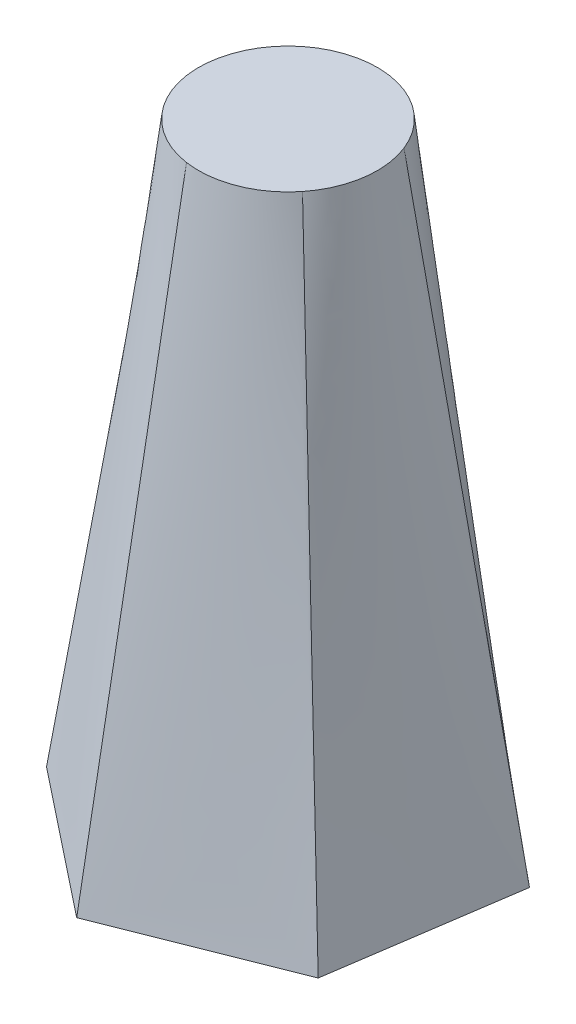
ISO-10303-21;
HEADER;
FILE_DESCRIPTION(('STEP AP214'),'2;1');
FILE_NAME('part.step','',(''),(''),'','','');
FILE_SCHEMA(('AUTOMOTIVE_DESIGN { 1 0 10303 214 1 1 1 1 }'));
ENDSEC;
DATA;
#1=APPLICATION_CONTEXT('core data for automotive mechanical design processes');
#2=APPLICATION_PROTOCOL_DEFINITION('international standard','automotive_design',2000,#1);
#3=PRODUCT_CONTEXT('',#1,'mechanical');
#4=PRODUCT('Part','Part','',(#3));
#5=PRODUCT_RELATED_PRODUCT_CATEGORY('part','',(#4));
#6=PRODUCT_DEFINITION_FORMATION('','',#4);
#7=PRODUCT_DEFINITION_CONTEXT('part definition',#1,'design');
#8=PRODUCT_DEFINITION('design','',#6,#7);
#9=PRODUCT_DEFINITION_SHAPE('','',#8);
#10=(LENGTH_UNIT() NAMED_UNIT(*) SI_UNIT(.MILLI.,.METRE.));
#11=(NAMED_UNIT(*) PLANE_ANGLE_UNIT() SI_UNIT($,.RADIAN.));
#12=(NAMED_UNIT(*) SI_UNIT($,.STERADIAN.) SOLID_ANGLE_UNIT());
#13=UNCERTAINTY_MEASURE_WITH_UNIT(LENGTH_MEASURE(1.E-05),#10,'distance_accuracy_value','');
#14=(GEOMETRIC_REPRESENTATION_CONTEXT(3) GLOBAL_UNCERTAINTY_ASSIGNED_CONTEXT((#13)) GLOBAL_UNIT_ASSIGNED_CONTEXT((#10,
#11,#12)) REPRESENTATION_CONTEXT('',''));
#15=CARTESIAN_POINT('',(0.,0.,0.));
#16=DIRECTION('',(0.,0.,1.));
#17=DIRECTION('',(1.,0.,0.));
#18=AXIS2_PLACEMENT_3D('',#15,#16,#17);
#19=CARTESIAN_POINT('',(0.,100.,0.));
#20=DIRECTION('',(0.,1.,0.));
#21=DIRECTION('',(0.,0.,1.));
#22=AXIS2_PLACEMENT_3D('',#19,#20,#21);
#23=PLANE('',#22);
#24=CARTESIAN_POINT('',(0.,100.,0.));
#25=DIRECTION('',(0.,1.,0.));
#26=DIRECTION('',(0.,0.,1.));
#27=AXIS2_PLACEMENT_3D('',#24,#25,#26);
#28=CIRCLE('',#27,14.5793534464195);
#29=CARTESIAN_POINT('',(2.13323559379029,100.,-14.422442678583));
#30=VERTEX_POINT('',#29);
#31=CARTESIAN_POINT('',(-11.4235839473826,100.,-9.05865755577106));
#32=VERTEX_POINT('',#31);
#33=EDGE_CURVE('E12',#30,#32,#28,.T.);
#34=ORIENTED_EDGE('',*,*,#33,.T.);
#35=CARTESIAN_POINT('',(-13.5568195411729,100.,5.36378512281191));
#36=VERTEX_POINT('',#35);
#37=EDGE_CURVE('E98',#32,#36,#28,.T.);
#38=ORIENTED_EDGE('',*,*,#37,.T.);
#39=CARTESIAN_POINT('',(-2.1332355937903,100.,14.422442678583));
#40=VERTEX_POINT('',#39);
#41=EDGE_CURVE('E341',#36,#40,#28,.T.);
#42=ORIENTED_EDGE('',*,*,#41,.T.);
#43=CARTESIAN_POINT('',(11.4235839473826,100.,9.05865755577104));
#44=VERTEX_POINT('',#43);
#45=EDGE_CURVE('E226',#40,#44,#28,.T.);
#46=ORIENTED_EDGE('',*,*,#45,.T.);
#47=CARTESIAN_POINT('',(13.5568195411729,100.,-5.3637851228119));
#48=VERTEX_POINT('',#47);
#49=EDGE_CURVE('E348',#44,#48,#28,.T.);
#50=ORIENTED_EDGE('',*,*,#49,.T.);
#51=EDGE_CURVE('E174',#48,#30,#28,.T.);
#52=ORIENTED_EDGE('',*,*,#51,.T.);
#53=EDGE_LOOP('',(#34,#38,#42,#46,#50,#52));
#54=FACE_BOUND('',#53,.T.);
#55=ADVANCED_FACE('F87',(#54),#23,.T.);
#56=CARTESIAN_POINT('',(0.,0.,0.));
#57=DIRECTION('',(0.,1.,0.));
#58=DIRECTION('',(0.,0.,1.));
#59=AXIS2_PLACEMENT_3D('',#56,#57,#58);
#60=PLANE('',#59);
#61=DIRECTION('',(0.146318943540954,0.,-0.989237467325748));
#62=VECTOR('',#61,1.);
#63=CARTESIAN_POINT('',(23.7746978672608,0.,18.8528265265456));
#64=LINE('',#63,#62);
#65=CARTESIAN_POINT('',(23.7746978672608,0.,18.8528265265456));
#66=VERTEX_POINT('',#65);
#67=CARTESIAN_POINT('',(28.21437563876,0.,-11.1630790570747));
#68=VERTEX_POINT('',#67);
#69=EDGE_CURVE('E146',#66,#68,#64,.T.);
#70=ORIENTED_EDGE('',*,*,#69,.F.);
#71=DIRECTION('',(0.929864248849953,0.,-0.367902811501507));
#72=VECTOR('',#71,1.);
#73=CARTESIAN_POINT('',(-4.43967777149929,0.,30.0159055836203));
#74=LINE('',#73,#72);
#75=CARTESIAN_POINT('',(-4.43967777149929,0.,30.0159055836203));
#76=VERTEX_POINT('',#75);
#77=EDGE_CURVE('E280',#76,#66,#74,.T.);
#78=ORIENTED_EDGE('',*,*,#77,.F.);
#79=DIRECTION('',(0.783545305308998,0.,0.621334655824242));
#80=VECTOR('',#79,1.);
#81=CARTESIAN_POINT('',(-28.21437563876,0.,11.1630790570747));
#82=LINE('',#81,#80);
#83=CARTESIAN_POINT('',(-28.21437563876,0.,11.1630790570747));
#84=VERTEX_POINT('',#83);
#85=EDGE_CURVE('E290',#84,#76,#82,.T.);
#86=ORIENTED_EDGE('',*,*,#85,.F.);
#87=DIRECTION('',(-0.146318943540955,0.,0.989237467325747));
#88=VECTOR('',#87,1.);
#89=CARTESIAN_POINT('',(-23.7746978672607,0.,-18.8528265265456));
#90=LINE('',#89,#88);
#91=CARTESIAN_POINT('',(-23.7746978672607,0.,-18.8528265265456));
#92=VERTEX_POINT('',#91);
#93=EDGE_CURVE('E376',#92,#84,#90,.T.);
#94=ORIENTED_EDGE('',*,*,#93,.F.);
#95=DIRECTION('',(-0.929864248849953,0.,0.367902811501505));
#96=VECTOR('',#95,1.);
#97=CARTESIAN_POINT('',(4.43967777149931,0.,-30.0159055836203));
#98=LINE('',#97,#96);
#99=CARTESIAN_POINT('',(4.43967777149931,0.,-30.0159055836203));
#100=VERTEX_POINT('',#99);
#101=EDGE_CURVE('E149',#100,#92,#98,.T.);
#102=ORIENTED_EDGE('',*,*,#101,.F.);
#103=DIRECTION('',(-0.783545305308998,0.,-0.621334655824242));
#104=VECTOR('',#103,1.);
#105=CARTESIAN_POINT('',(28.21437563876,0.,-11.1630790570747));
#106=LINE('',#105,#104);
#107=EDGE_CURVE('E142',#68,#100,#106,.T.);
#108=ORIENTED_EDGE('',*,*,#107,.F.);
#109=EDGE_LOOP('',(#70,#78,#86,#94,#102,#108));
#110=FACE_BOUND('',#109,.T.);
#111=ADVANCED_FACE('F145',(#110),#60,.F.);
#112=CARTESIAN_POINT('',(-23.7746978672607,0.,-18.8528265265456));
#113=CARTESIAN_POINT('',(-11.4235839473826,100.,-9.05865755577106));
#114=CARTESIAN_POINT('',(-24.1446710148857,0.,-16.3515010612439));
#115=CARTESIAN_POINT('',(-12.1784720770302,100.,-8.10669222682251));
#116=CARTESIAN_POINT('',(-24.5146441625106,0.,-13.8501755959422));
#117=CARTESIAN_POINT('',(-12.8386403325706,100.,-7.02589858761081));
#118=CARTESIAN_POINT('',(-25.2545904577605,0.,-8.84752466533885));
#119=CARTESIAN_POINT('',(-13.865978770345,100.,-4.68279502998372));
#120=CARTESIAN_POINT('',(-25.6245636053854,0.,-6.34619920003716));
#121=CARTESIAN_POINT('',(-14.2319097603758,100.,-3.42139621666044));
#122=CARTESIAN_POINT('',(-26.3645099006353,0.,-1.34354826943378));
#123=CARTESIAN_POINT('',(-14.6129755967901,100.,-0.845074970920135));
#124=CARTESIAN_POINT('',(-26.7344830482603,0.,1.15777719586791));
#125=CARTESIAN_POINT('',(-14.6278734872154,100.,0.468245442603986));
#126=CARTESIAN_POINT('',(-27.4744293435101,0.,6.16042812647129));
#127=CARTESIAN_POINT('',(-14.3228253174044,100.,3.00842342093317));
#128=CARTESIAN_POINT('',(-27.8444024911351,0.,8.66175359177297));
#129=CARTESIAN_POINT('',(-14.0038016347405,100.,4.23405016104751));
#130=CARTESIAN_POINT('',(-28.21437563876,0.,11.1630790570747));
#131=CARTESIAN_POINT('',(-13.5568195411729,100.,5.36378512281191));
#132=B_SPLINE_SURFACE_WITH_KNOTS('',3,1,((#112,#113),(#114,#115),(#116,#117),(#118,#119),(#120,
#121),(#122,#123),(#124,#125),(#126,#127),(#128,#129),(#130,#131)),.UNSPECIFIED.,.F.,.F.,.F.,(4,
2,2,2,4),(2,2),(0.,0.25,0.5,0.75,1.),(0.,1.),.UNSPECIFIED.);
#133=DIRECTION('',(0.144787785546289,0.987803045625892,-0.057285602107445));
#134=VECTOR('',#133,1.);
#135=CARTESIAN_POINT('',(-20.8855975899664,50.,8.26343208994328));
#136=LINE('',#135,#134);
#137=EDGE_CURVE('E266',#84,#36,#136,.T.);
#138=DIRECTION('',(-0.12200467946928,-0.987803045625892,-0.0967470993870575));
#139=VECTOR('',#138,1.);
#140=CARTESIAN_POINT('',(-17.5991409073217,50.,-13.9557420411584));
#141=LINE('',#140,#139);
#142=EDGE_CURVE('E273',#32,#92,#141,.T.);
#143=ORIENTED_EDGE('',*,*,#93,.T.);
#144=ORIENTED_EDGE('',*,*,#137,.T.);
#145=ORIENTED_EDGE('',*,*,#37,.F.);
#146=ORIENTED_EDGE('',*,*,#142,.T.);
#147=EDGE_LOOP('',(#143,#144,#145,#146));
#148=FACE_BOUND('',#147,.T.);
#149=ADVANCED_FACE('F303',(#148),#132,.T.);
#150=CARTESIAN_POINT('',(-28.21437563876,0.,11.1630790570747));
#151=CARTESIAN_POINT('',(-13.5568195411729,100.,5.36378512281191));
#152=CARTESIAN_POINT('',(-26.2331508164882,0.,12.7341479342869));
#153=CARTESIAN_POINT('',(-13.1098374476052,100.,6.49352008457632));
#154=CARTESIAN_POINT('',(-24.2519259942165,0.,14.305216811499));
#155=CARTESIAN_POINT('',(-12.5039268275694,100.,7.60563938425219));
#156=CARTESIAN_POINT('',(-20.289476349673,0.,17.4473545659233));
#157=CARTESIAN_POINT('',(-10.9884088418539,100.,9.66689234846263));
#158=CARTESIAN_POINT('',(-18.3082515274012,0.,19.0184234431355));
#159=CARTESIAN_POINT('',(-10.0789709202278,100.,10.6144972885229));
#160=CARTESIAN_POINT('',(-14.3458018828578,0.,22.1605611975598));
#161=CARTESIAN_POINT('',(-8.03834419131429,100.,12.2326706062422));
#162=CARTESIAN_POINT('',(-12.3645770605861,0.,23.7316300747719));
#163=CARTESIAN_POINT('',(-6.90842429510637,100.,12.9022327645754));
#164=CARTESIAN_POINT('',(-8.40212741604266,0.,26.8737678291961));
#165=CARTESIAN_POINT('',(-4.55604155083398,100.,13.9081422893057));
#166=CARTESIAN_POINT('',(-6.42090259377097,0.,28.4448367064082));
#167=CARTESIAN_POINT('',(-3.33510581700554,100.,14.2446730457671));
#168=CARTESIAN_POINT('',(-4.4396777714993,0.,30.0159055836203));
#169=CARTESIAN_POINT('',(-2.1332355937903,100.,14.422442678583));
#170=B_SPLINE_SURFACE_WITH_KNOTS('',3,1,((#150,#151),(#152,#153),(#154,#155),(#156,#157),(#158,
#159),(#160,#161),(#162,#163),(#164,#165),(#166,#167),(#168,#169)),.UNSPECIFIED.,.F.,.F.,.F.,(4,
2,2,2,4),(2,2),(0.,0.25,0.5,0.75,1.),(0.,1.),.UNSPECIFIED.);
#171=DIRECTION('',(0.0227831060770097,0.987803045625892,-0.154032701494503));
#172=VECTOR('',#171,1.);
#173=CARTESIAN_POINT('',(-3.2864566826448,50.,22.2191741311016));
#174=LINE('',#173,#172);
#175=EDGE_CURVE('E182',#76,#40,#174,.T.);
#176=ORIENTED_EDGE('',*,*,#85,.T.);
#177=ORIENTED_EDGE('',*,*,#175,.T.);
#178=ORIENTED_EDGE('',*,*,#41,.F.);
#179=ORIENTED_EDGE('',*,*,#137,.F.);
#180=EDGE_LOOP('',(#176,#177,#178,#179));
#181=FACE_BOUND('',#180,.T.);
#182=ADVANCED_FACE('F293',(#181),#170,.T.);
#183=CARTESIAN_POINT('',(4.43967777149931,0.,-30.0159055836203));
#184=CARTESIAN_POINT('',(2.13323559379029,100.,-14.422442678583));
#185=CARTESIAN_POINT('',(2.08847980160264,0.,-29.0856489955308));
#186=CARTESIAN_POINT('',(0.931365370575047,100.,-14.6002123113988));
#187=CARTESIAN_POINT('',(-0.262718168294023,0.,-28.1553924074412));
#188=CARTESIAN_POINT('',(-0.334713505001106,100.,-14.631537971863));
#189=CARTESIAN_POINT('',(-4.96511410808736,0.,-26.2948792312621));
#190=CARTESIAN_POINT('',(-2.87756992849109,100.,-14.3496873784464));
#191=CARTESIAN_POINT('',(-7.31631207798403,0.,-25.3646226431725));
#192=CARTESIAN_POINT('',(-4.152938840148,100.,-14.0358935051834));
#193=CARTESIAN_POINT('',(-12.0187080177774,0.,-23.5041094669934));
#194=CARTESIAN_POINT('',(-6.57463140547583,100.,-13.0777455771624));
#195=CARTESIAN_POINT('',(-14.369905987674,0.,-22.5738528789039));
#196=CARTESIAN_POINT('',(-7.71944919210904,100.,-12.4339873219714));
#197=CARTESIAN_POINT('',(-19.0723019274674,0.,-20.7133397027248));
#198=CARTESIAN_POINT('',(-9.7667837665704,100.,-10.8997188683725));
#199=CARTESIAN_POINT('',(-21.423499897364,0.,-19.7830831146352));
#200=CARTESIAN_POINT('',(-10.668695817735,100.,-10.0106228847196));
#201=CARTESIAN_POINT('',(-23.7746978672607,0.,-18.8528265265456));
#202=CARTESIAN_POINT('',(-11.4235839473826,100.,-9.05865755577106));
#203=B_SPLINE_SURFACE_WITH_KNOTS('',3,1,((#183,#184),(#185,#186),(#187,#188),(#189,#190),(#191,
#192),(#193,#194),(#195,#196),(#197,#198),(#199,#200),(#201,#202)),.UNSPECIFIED.,.F.,.F.,.F.,(4,
2,2,2,4),(2,2),(0.,0.25,0.5,0.75,1.),(0.,1.),.UNSPECIFIED.);
#204=DIRECTION('',(-0.0227831060770098,0.987803045625892,0.154032701494503));
#205=VECTOR('',#204,1.);
#206=CARTESIAN_POINT('',(3.2864566826448,50.,-22.2191741311016));
#207=LINE('',#206,#205);
#208=EDGE_CURVE('E177',#100,#30,#207,.T.);
#209=ORIENTED_EDGE('',*,*,#101,.T.);
#210=ORIENTED_EDGE('',*,*,#142,.F.);
#211=ORIENTED_EDGE('',*,*,#33,.F.);
#212=ORIENTED_EDGE('',*,*,#208,.F.);
#213=EDGE_LOOP('',(#209,#210,#211,#212));
#214=FACE_BOUND('',#213,.T.);
#215=ADVANCED_FACE('F243',(#214),#203,.T.);
#216=CARTESIAN_POINT('',(-4.43967777149929,0.,30.0159055836203));
#217=CARTESIAN_POINT('',(-2.1332355937903,100.,14.422442678583));
#218=CARTESIAN_POINT('',(-2.08847980160262,0.,29.0856489955308));
#219=CARTESIAN_POINT('',(-0.931365370575046,100.,14.6002123113988));
#220=CARTESIAN_POINT('',(0.26271816829405,0.,28.1553924074412));
#221=CARTESIAN_POINT('',(0.334713505001109,100.,14.631537971863));
#222=CARTESIAN_POINT('',(4.96511410808739,0.,26.2948792312621));
#223=CARTESIAN_POINT('',(2.8775699284911,100.,14.3496873784463));
#224=CARTESIAN_POINT('',(7.31631207798407,0.,25.3646226431725));
#225=CARTESIAN_POINT('',(4.15293884014801,100.,14.0358935051834));
#226=CARTESIAN_POINT('',(12.0187080177774,0.,23.5041094669934));
#227=CARTESIAN_POINT('',(6.57463140547584,100.,13.0777455771624));
#228=CARTESIAN_POINT('',(14.3699059876741,0.,22.5738528789038));
#229=CARTESIAN_POINT('',(7.71944919210906,100.,12.4339873219714));
#230=CARTESIAN_POINT('',(19.0723019274674,0.,20.7133397027247));
#231=CARTESIAN_POINT('',(9.76678376657042,100.,10.8997188683725));
#232=CARTESIAN_POINT('',(21.4234998973641,0.,19.7830831146351));
#233=CARTESIAN_POINT('',(10.668695817735,100.,10.0106228847196));
#234=CARTESIAN_POINT('',(23.7746978672608,0.,18.8528265265456));
#235=CARTESIAN_POINT('',(11.4235839473826,100.,9.05865755577104));
#236=B_SPLINE_SURFACE_WITH_KNOTS('',3,1,((#216,#217),(#218,#219),(#220,#221),(#222,#223),(#224,
#225),(#226,#227),(#228,#229),(#230,#231),(#232,#233),(#234,#235)),.UNSPECIFIED.,.F.,.F.,.F.,(4,
2,2,2,4),(2,2),(0.,0.25,0.5,0.75,1.),(0.,1.),.UNSPECIFIED.);
#237=DIRECTION('',(-0.12200467946928,0.987803045625892,-0.0967470993870569));
#238=VECTOR('',#237,1.);
#239=CARTESIAN_POINT('',(17.5991409073217,50.,13.9557420411583));
#240=LINE('',#239,#238);
#241=EDGE_CURVE('E166',#66,#44,#240,.T.);
#242=ORIENTED_EDGE('',*,*,#77,.T.);
#243=ORIENTED_EDGE('',*,*,#241,.T.);
#244=ORIENTED_EDGE('',*,*,#45,.F.);
#245=ORIENTED_EDGE('',*,*,#175,.F.);
#246=EDGE_LOOP('',(#242,#243,#244,#245));
#247=FACE_BOUND('',#246,.T.);
#248=ADVANCED_FACE('F232',(#247),#236,.T.);
#249=CARTESIAN_POINT('',(23.7746978672608,0.,18.8528265265456));
#250=CARTESIAN_POINT('',(11.4235839473826,100.,9.05865755577104));
#251=CARTESIAN_POINT('',(24.1446710148857,0.,16.3515010612439));
#252=CARTESIAN_POINT('',(12.1784720770302,100.,8.10669222682249));
#253=CARTESIAN_POINT('',(24.5146441625107,0.,13.8501755959422));
#254=CARTESIAN_POINT('',(12.8386403325706,100.,7.02589858761078));
#255=CARTESIAN_POINT('',(25.2545904577605,0.,8.84752466533882));
#256=CARTESIAN_POINT('',(13.865978770345,100.,4.6827950299837));
#257=CARTESIAN_POINT('',(25.6245636053855,0.,6.34619920003714));
#258=CARTESIAN_POINT('',(14.2319097603758,100.,3.42139621666043));
#259=CARTESIAN_POINT('',(26.3645099006353,0.,1.34354826943376));
#260=CARTESIAN_POINT('',(14.6129755967901,100.,0.845074970920129));
#261=CARTESIAN_POINT('',(26.7344830482603,0.,-1.15777719586793));
#262=CARTESIAN_POINT('',(14.6278734872154,100.,-0.468245442603989));
#263=CARTESIAN_POINT('',(27.4744293435101,0.,-6.1604281264713));
#264=CARTESIAN_POINT('',(14.3228253174044,100.,-3.00842342093316));
#265=CARTESIAN_POINT('',(27.8444024911351,0.,-8.66175359177299));
#266=CARTESIAN_POINT('',(14.0038016347405,100.,-4.2340501610475));
#267=CARTESIAN_POINT('',(28.21437563876,0.,-11.1630790570747));
#268=CARTESIAN_POINT('',(13.5568195411729,100.,-5.3637851228119));
#269=B_SPLINE_SURFACE_WITH_KNOTS('',3,1,((#249,#250),(#251,#252),(#253,#254),(#255,#256),(#257,
#258),(#259,#260),(#261,#262),(#263,#264),(#265,#266),(#267,#268)),.UNSPECIFIED.,.F.,.F.,.F.,(4,
2,2,2,4),(2,2),(0.,0.25,0.5,0.75,1.),(0.,1.),.UNSPECIFIED.);
#270=DIRECTION('',(-0.144787785546289,0.987803045625892,0.0572856021074454));
#271=VECTOR('',#270,1.);
#272=CARTESIAN_POINT('',(20.8855975899665,50.,-8.2634320899433));
#273=LINE('',#272,#271);
#274=EDGE_CURVE('E164',#68,#48,#273,.T.);
#275=ORIENTED_EDGE('',*,*,#69,.T.);
#276=ORIENTED_EDGE('',*,*,#274,.T.);
#277=ORIENTED_EDGE('',*,*,#49,.F.);
#278=ORIENTED_EDGE('',*,*,#241,.F.);
#279=EDGE_LOOP('',(#275,#276,#277,#278));
#280=FACE_BOUND('',#279,.T.);
#281=ADVANCED_FACE('F162',(#280),#269,.T.);
#282=CARTESIAN_POINT('',(28.21437563876,0.,-11.1630790570747));
#283=CARTESIAN_POINT('',(13.5568195411729,100.,-5.3637851228119));
#284=CARTESIAN_POINT('',(26.2331508164883,0.,-12.7341479342868));
#285=CARTESIAN_POINT('',(13.1098374476052,100.,-6.49352008457631));
#286=CARTESIAN_POINT('',(24.2519259942166,0.,-14.305216811499));
#287=CARTESIAN_POINT('',(12.5039268275694,100.,-7.60563938425218));
#288=CARTESIAN_POINT('',(20.2894763496731,0.,-17.4473545659232));
#289=CARTESIAN_POINT('',(10.9884088418539,100.,-9.66689234846263));
#290=CARTESIAN_POINT('',(18.3082515274014,0.,-19.0184234431354));
#291=CARTESIAN_POINT('',(10.0789709202278,100.,-10.6144972885229));
#292=CARTESIAN_POINT('',(14.3458018828579,0.,-22.1605611975596));
#293=CARTESIAN_POINT('',(8.0383441913143,100.,-12.2326706062422));
#294=CARTESIAN_POINT('',(12.3645770605862,0.,-23.7316300747718));
#295=CARTESIAN_POINT('',(6.90842429510637,100.,-12.9022327645754));
#296=CARTESIAN_POINT('',(8.40212741604275,0.,-26.873767829196));
#297=CARTESIAN_POINT('',(4.55604155083398,100.,-13.9081422893057));
#298=CARTESIAN_POINT('',(6.42090259377103,0.,-28.4448367064082));
#299=CARTESIAN_POINT('',(3.33510581700554,100.,-14.2446730457671));
#300=CARTESIAN_POINT('',(4.43967777149931,0.,-30.0159055836203));
#301=CARTESIAN_POINT('',(2.13323559379029,100.,-14.422442678583));
#302=B_SPLINE_SURFACE_WITH_KNOTS('',3,1,((#282,#283),(#284,#285),(#286,#287),(#288,#289),(#290,
#291),(#292,#293),(#294,#295),(#296,#297),(#298,#299),(#300,#301)),.UNSPECIFIED.,.F.,.F.,.F.,(4,
2,2,2,4),(2,2),(0.,0.25,0.5,0.75,1.),(0.,1.),.UNSPECIFIED.);
#303=ORIENTED_EDGE('',*,*,#107,.T.);
#304=ORIENTED_EDGE('',*,*,#208,.T.);
#305=ORIENTED_EDGE('',*,*,#51,.F.);
#306=ORIENTED_EDGE('',*,*,#274,.F.);
#307=EDGE_LOOP('',(#303,#304,#305,#306));
#308=FACE_BOUND('',#307,.T.);
#309=ADVANCED_FACE('F173',(#308),#302,.T.);
#310=CLOSED_SHELL('',(#55,#111,#149,#182,#215,#248,#281,#309));
#311=MANIFOLD_SOLID_BREP('B2',#310);
#312=ADVANCED_BREP_SHAPE_REPRESENTATION('',(#18,#311),#14);
#313=SHAPE_DEFINITION_REPRESENTATION(#9,#312);
ENDSEC;
END-ISO-10303-21;
